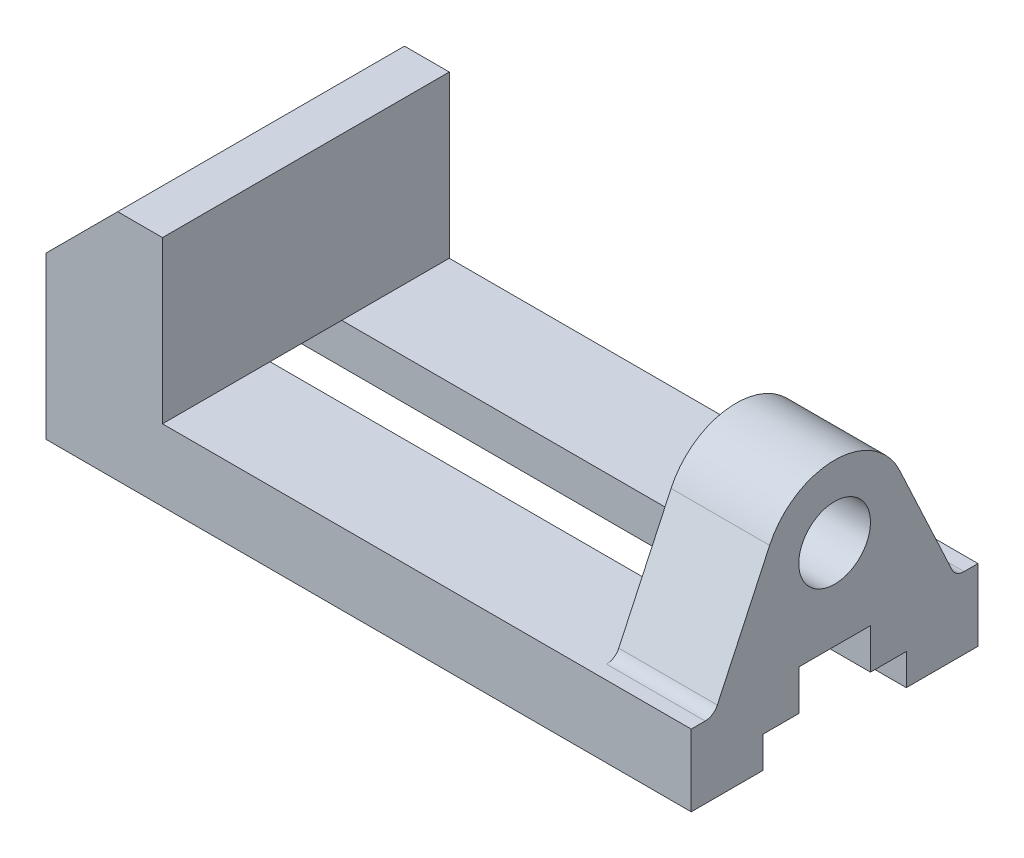
ISO-10303-21;
HEADER;
FILE_DESCRIPTION(('STEP AP214'),'2;1');
FILE_NAME('part.step','',(''),(''),'','','');
FILE_SCHEMA(('AUTOMOTIVE_DESIGN { 1 0 10303 214 1 1 1 1 }'));
ENDSEC;
DATA;
#1=APPLICATION_CONTEXT('core data for automotive mechanical design processes');
#2=APPLICATION_PROTOCOL_DEFINITION('international standard','automotive_design',2000,#1);
#3=PRODUCT_CONTEXT('',#1,'mechanical');
#4=PRODUCT('Part','Part','',(#3));
#5=PRODUCT_RELATED_PRODUCT_CATEGORY('part','',(#4));
#6=PRODUCT_DEFINITION_FORMATION('','',#4);
#7=PRODUCT_DEFINITION_CONTEXT('part definition',#1,'design');
#8=PRODUCT_DEFINITION('design','',#6,#7);
#9=PRODUCT_DEFINITION_SHAPE('','',#8);
#10=(LENGTH_UNIT() NAMED_UNIT(*) SI_UNIT(.MILLI.,.METRE.));
#11=(NAMED_UNIT(*) PLANE_ANGLE_UNIT() SI_UNIT($,.RADIAN.));
#12=(NAMED_UNIT(*) SI_UNIT($,.STERADIAN.) SOLID_ANGLE_UNIT());
#13=UNCERTAINTY_MEASURE_WITH_UNIT(LENGTH_MEASURE(1.E-05),#10,'distance_accuracy_value','');
#14=(GEOMETRIC_REPRESENTATION_CONTEXT(3) GLOBAL_UNCERTAINTY_ASSIGNED_CONTEXT((#13)) GLOBAL_UNIT_ASSIGNED_CONTEXT((#10,
#11,#12)) REPRESENTATION_CONTEXT('',''));
#15=CARTESIAN_POINT('',(0.,0.,0.));
#16=DIRECTION('',(0.,0.,1.));
#17=DIRECTION('',(1.,0.,0.));
#18=AXIS2_PLACEMENT_3D('',#15,#16,#17);
#19=CARTESIAN_POINT('',(0.,0.,32.));
#20=DIRECTION('',(0.,1.,0.));
#21=DIRECTION('',(0.,0.,1.));
#22=AXIS2_PLACEMENT_3D('',#19,#20,#21);
#23=PLANE('',#22);
#24=CARTESIAN_POINT('',(108.,0.,22.));
#25=DIRECTION('',(0.,-1.,0.));
#26=DIRECTION('',(0.,0.,-1.));
#27=AXIS2_PLACEMENT_3D('',#24,#25,#26);
#28=CIRCLE('',#27,2.99999999999999);
#29=CARTESIAN_POINT('',(108.,0.,19.));
#30=VERTEX_POINT('',#29);
#31=EDGE_CURVE('E211',#30,#30,#28,.T.);
#32=ORIENTED_EDGE('',*,*,#31,.F.);
#33=EDGE_LOOP('',(#32));
#34=FACE_BOUND('',#33,.T.);
#35=CARTESIAN_POINT('',(38.,0.,22.));
#36=DIRECTION('',(0.,-1.,0.));
#37=DIRECTION('',(0.,0.,-1.));
#38=AXIS2_PLACEMENT_3D('',#35,#36,#37);
#39=CIRCLE('',#38,2.99999999999999);
#40=CARTESIAN_POINT('',(38.,0.,19.));
#41=VERTEX_POINT('',#40);
#42=EDGE_CURVE('E228',#41,#41,#39,.T.);
#43=ORIENTED_EDGE('',*,*,#42,.F.);
#44=EDGE_LOOP('',(#43));
#45=FACE_BOUND('',#44,.T.);
#46=DIRECTION('',(0.,0.,-1.));
#47=VECTOR('',#46,1.);
#48=CARTESIAN_POINT('',(0.,0.,32.));
#49=LINE('',#48,#47);
#50=CARTESIAN_POINT('',(0.,0.,32.));
#51=VERTEX_POINT('',#50);
#52=CARTESIAN_POINT('',(0.,0.,16.));
#53=VERTEX_POINT('',#52);
#54=EDGE_CURVE('E387',#51,#53,#49,.T.);
#55=ORIENTED_EDGE('',*,*,#54,.T.);
#56=DIRECTION('',(1.,0.,0.));
#57=VECTOR('',#56,1.);
#58=CARTESIAN_POINT('',(0.,0.,16.));
#59=LINE('',#58,#57);
#60=CARTESIAN_POINT('',(144.,0.,16.));
#61=VERTEX_POINT('',#60);
#62=EDGE_CURVE('E255',#53,#61,#59,.T.);
#63=ORIENTED_EDGE('',*,*,#62,.T.);
#64=DIRECTION('',(0.,0.,-1.));
#65=VECTOR('',#64,1.);
#66=CARTESIAN_POINT('',(144.,0.,32.));
#67=LINE('',#66,#65);
#68=CARTESIAN_POINT('',(144.,0.,32.));
#69=VERTEX_POINT('',#68);
#70=EDGE_CURVE('E11',#69,#61,#67,.T.);
#71=ORIENTED_EDGE('',*,*,#70,.F.);
#72=DIRECTION('',(1.,0.,0.));
#73=VECTOR('',#72,1.);
#74=CARTESIAN_POINT('',(0.,0.,32.));
#75=LINE('',#74,#73);
#76=EDGE_CURVE('E354',#51,#69,#75,.T.);
#77=ORIENTED_EDGE('',*,*,#76,.F.);
#78=EDGE_LOOP('',(#55,#63,#71,#77));
#79=FACE_BOUND('',#78,.T.);
#80=ADVANCED_FACE('F35',(#34,#45,#79),#23,.F.);
#81=CARTESIAN_POINT('',(26.,16.,32.));
#82=DIRECTION('',(0.,-1.,0.));
#83=DIRECTION('',(0.,0.,-1.));
#84=AXIS2_PLACEMENT_3D('',#81,#82,#83);
#85=PLANE('',#84);
#86=DIRECTION('',(0.,0.,1.));
#87=VECTOR('',#86,1.);
#88=CARTESIAN_POINT('',(122.,16.,0.));
#89=LINE('',#88,#87);
#90=CARTESIAN_POINT('',(122.,16.,8.));
#91=VERTEX_POINT('',#90);
#92=CARTESIAN_POINT('',(122.,16.,28.8914106489224));
#93=VERTEX_POINT('',#92);
#94=EDGE_CURVE('E314',#91,#93,#89,.T.);
#95=ORIENTED_EDGE('',*,*,#94,.F.);
#96=DIRECTION('',(1.,0.,0.));
#97=VECTOR('',#96,1.);
#98=CARTESIAN_POINT('',(0.,16.,8.));
#99=LINE('',#98,#97);
#100=CARTESIAN_POINT('',(26.,16.,8.));
#101=VERTEX_POINT('',#100);
#102=EDGE_CURVE('E58',#101,#91,#99,.T.);
#103=ORIENTED_EDGE('',*,*,#102,.F.);
#104=DIRECTION('',(0.,0.,-1.));
#105=VECTOR('',#104,1.);
#106=CARTESIAN_POINT('',(26.,16.,32.));
#107=LINE('',#106,#105);
#108=CARTESIAN_POINT('',(26.,16.,32.));
#109=VERTEX_POINT('',#108);
#110=EDGE_CURVE('E400',#109,#101,#107,.T.);
#111=ORIENTED_EDGE('',*,*,#110,.F.);
#112=DIRECTION('',(-1.,0.,0.));
#113=VECTOR('',#112,1.);
#114=CARTESIAN_POINT('',(26.,16.,32.));
#115=LINE('',#114,#113);
#116=CARTESIAN_POINT('',(144.,16.,32.));
#117=VERTEX_POINT('',#116);
#118=EDGE_CURVE('E360',#117,#109,#115,.T.);
#119=ORIENTED_EDGE('',*,*,#118,.F.);
#120=DIRECTION('',(0.,0.,-1.));
#121=VECTOR('',#120,1.);
#122=CARTESIAN_POINT('',(144.,16.,32.));
#123=LINE('',#122,#121);
#124=CARTESIAN_POINT('',(144.,16.,28.8914106489224));
#125=VERTEX_POINT('',#124);
#126=EDGE_CURVE('E403',#117,#125,#123,.T.);
#127=ORIENTED_EDGE('',*,*,#126,.T.);
#128=DIRECTION('',(1.,0.,0.));
#129=VECTOR('',#128,1.);
#130=CARTESIAN_POINT('',(122.,16.,28.8914106489224));
#131=LINE('',#130,#129);
#132=EDGE_CURVE('E346',#93,#125,#131,.T.);
#133=ORIENTED_EDGE('',*,*,#132,.F.);
#134=EDGE_LOOP('',(#95,#103,#111,#119,#127,#133));
#135=FACE_BOUND('',#134,.T.);
#136=ADVANCED_FACE('F439',(#135),#85,.F.);
#137=CARTESIAN_POINT('',(108.,0.,-22.));
#138=DIRECTION('',(0.,-1.,0.));
#139=DIRECTION('',(0.,0.,-1.));
#140=AXIS2_PLACEMENT_3D('',#137,#138,#139);
#141=CIRCLE('',#140,2.99999999999999);
#142=CARTESIAN_POINT('',(108.,0.,-25.));
#143=VERTEX_POINT('',#142);
#144=EDGE_CURVE('E212',#143,#143,#141,.T.);
#145=ORIENTED_EDGE('',*,*,#144,.F.);
#146=EDGE_LOOP('',(#145));
#147=FACE_BOUND('',#146,.T.);
#148=CARTESIAN_POINT('',(38.,0.,-22.));
#149=DIRECTION('',(0.,-1.,0.));
#150=DIRECTION('',(0.,0.,-1.));
#151=AXIS2_PLACEMENT_3D('',#148,#149,#150);
#152=CIRCLE('',#151,2.99999999999999);
#153=CARTESIAN_POINT('',(38.,0.,-25.));
#154=VERTEX_POINT('',#153);
#155=EDGE_CURVE('E222',#154,#154,#152,.T.);
#156=ORIENTED_EDGE('',*,*,#155,.F.);
#157=EDGE_LOOP('',(#156));
#158=FACE_BOUND('',#157,.T.);
#159=CARTESIAN_POINT('',(144.,0.,-16.));
#160=VERTEX_POINT('',#159);
#161=CARTESIAN_POINT('',(144.,0.,-32.));
#162=VERTEX_POINT('',#161);
#163=EDGE_CURVE('E43',#160,#162,#67,.T.);
#164=ORIENTED_EDGE('',*,*,#163,.F.);
#165=DIRECTION('',(1.,0.,0.));
#166=VECTOR('',#165,1.);
#167=CARTESIAN_POINT('',(0.,0.,-16.));
#168=LINE('',#167,#166);
#169=CARTESIAN_POINT('',(0.,0.,-16.));
#170=VERTEX_POINT('',#169);
#171=EDGE_CURVE('E291',#170,#160,#168,.T.);
#172=ORIENTED_EDGE('',*,*,#171,.F.);
#173=CARTESIAN_POINT('',(0.,0.,-32.));
#174=VERTEX_POINT('',#173);
#175=EDGE_CURVE('E370',#170,#174,#49,.T.);
#176=ORIENTED_EDGE('',*,*,#175,.T.);
#177=DIRECTION('',(1.,0.,0.));
#178=VECTOR('',#177,1.);
#179=CARTESIAN_POINT('',(0.,0.,-32.));
#180=LINE('',#179,#178);
#181=EDGE_CURVE('E342',#174,#162,#180,.T.);
#182=ORIENTED_EDGE('',*,*,#181,.T.);
#183=EDGE_LOOP('',(#164,#172,#176,#182));
#184=FACE_BOUND('',#183,.T.);
#185=ADVANCED_FACE('F37',(#147,#158,#184),#23,.F.);
#186=CARTESIAN_POINT('',(144.,16.,32.));
#187=DIRECTION('',(-1.,0.,0.));
#188=DIRECTION('',(0.,0.,1.));
#189=AXIS2_PLACEMENT_3D('',#186,#187,#188);
#190=PLANE('',#189);
#191=ORIENTED_EDGE('',*,*,#70,.T.);
#192=DIRECTION('',(0.,-1.,0.));
#193=VECTOR('',#192,1.);
#194=CARTESIAN_POINT('',(144.,0.,16.));
#195=LINE('',#194,#193);
#196=CARTESIAN_POINT('',(144.,7.,16.));
#197=VERTEX_POINT('',#196);
#198=EDGE_CURVE('E234',#197,#61,#195,.T.);
#199=ORIENTED_EDGE('',*,*,#198,.F.);
#200=DIRECTION('',(0.,0.,1.));
#201=VECTOR('',#200,1.);
#202=CARTESIAN_POINT('',(144.,7.,16.));
#203=LINE('',#202,#201);
#204=CARTESIAN_POINT('',(144.,7.,8.));
#205=VERTEX_POINT('',#204);
#206=EDGE_CURVE('E239',#205,#197,#203,.T.);
#207=ORIENTED_EDGE('',*,*,#206,.F.);
#208=DIRECTION('',(0.,-1.,0.));
#209=VECTOR('',#208,1.);
#210=CARTESIAN_POINT('',(144.,7.,8.));
#211=LINE('',#210,#209);
#212=CARTESIAN_POINT('',(144.,16.,8.));
#213=VERTEX_POINT('',#212);
#214=EDGE_CURVE('E269',#213,#205,#211,.T.);
#215=ORIENTED_EDGE('',*,*,#214,.F.);
#216=DIRECTION('',(0.,0.,1.));
#217=VECTOR('',#216,1.);
#218=CARTESIAN_POINT('',(144.,16.,8.));
#219=LINE('',#218,#217);
#220=CARTESIAN_POINT('',(144.,16.,-8.));
#221=VERTEX_POINT('',#220);
#222=EDGE_CURVE('E266',#221,#213,#219,.T.);
#223=ORIENTED_EDGE('',*,*,#222,.F.);
#224=DIRECTION('',(0.,1.,0.));
#225=VECTOR('',#224,1.);
#226=CARTESIAN_POINT('',(144.,16.,-8.));
#227=LINE('',#226,#225);
#228=CARTESIAN_POINT('',(144.,7.,-8.));
#229=VERTEX_POINT('',#228);
#230=EDGE_CURVE('E263',#229,#221,#227,.T.);
#231=ORIENTED_EDGE('',*,*,#230,.F.);
#232=DIRECTION('',(0.,0.,1.));
#233=VECTOR('',#232,1.);
#234=CARTESIAN_POINT('',(144.,7.,-8.));
#235=LINE('',#234,#233);
#236=CARTESIAN_POINT('',(144.,7.,-16.));
#237=VERTEX_POINT('',#236);
#238=EDGE_CURVE('E260',#237,#229,#235,.T.);
#239=ORIENTED_EDGE('',*,*,#238,.F.);
#240=DIRECTION('',(0.,1.,0.));
#241=VECTOR('',#240,1.);
#242=CARTESIAN_POINT('',(144.,0.,-16.));
#243=LINE('',#242,#241);
#244=EDGE_CURVE('E257',#160,#237,#243,.T.);
#245=ORIENTED_EDGE('',*,*,#244,.F.);
#246=ORIENTED_EDGE('',*,*,#163,.T.);
#247=DIRECTION('',(0.,1.,0.));
#248=VECTOR('',#247,1.);
#249=CARTESIAN_POINT('',(144.,16.,-32.));
#250=LINE('',#249,#248);
#251=CARTESIAN_POINT('',(144.,16.,-32.));
#252=VERTEX_POINT('',#251);
#253=EDGE_CURVE('E373',#162,#252,#250,.T.);
#254=ORIENTED_EDGE('',*,*,#253,.T.);
#255=CARTESIAN_POINT('',(144.,16.,-28.8914106489224));
#256=VERTEX_POINT('',#255);
#257=EDGE_CURVE('E402',#256,#252,#123,.T.);
#258=ORIENTED_EDGE('',*,*,#257,.F.);
#259=CARTESIAN_POINT('',(144.,19.,-28.8914106489223));
#260=DIRECTION('',(1.,0.,0.));
#261=DIRECTION('',(0.,0.,-1.));
#262=AXIS2_PLACEMENT_3D('',#259,#260,#261);
#263=CIRCLE('',#262,3.);
#264=CARTESIAN_POINT('',(144.,17.7321452147779,-26.1724872878124));
#265=VERTEX_POINT('',#264);
#266=EDGE_CURVE('E302',#265,#256,#263,.T.);
#267=ORIENTED_EDGE('',*,*,#266,.F.);
#268=DIRECTION('',(0.,-0.90630778703665,-0.4226182617407));
#269=VECTOR('',#268,1.);
#270=CARTESIAN_POINT('',(144.,13.1917152134935,-28.289724568728));
#271=LINE('',#270,#269);
#272=CARTESIAN_POINT('',(144.,42.7618921878512,-14.5009245925864));
#273=VERTEX_POINT('',#272);
#274=EDGE_CURVE('E325',#273,#265,#271,.T.);
#275=ORIENTED_EDGE('',*,*,#274,.F.);
#276=CARTESIAN_POINT('',(144.,36.,0.));
#277=DIRECTION('',(1.,0.,0.));
#278=DIRECTION('',(0.,0.,-1.));
#279=AXIS2_PLACEMENT_3D('',#276,#277,#278);
#280=CIRCLE('',#279,16.);
#281=CARTESIAN_POINT('',(144.,42.7618921878512,14.5009245925864));
#282=VERTEX_POINT('',#281);
#283=EDGE_CURVE('E328',#273,#282,#280,.T.);
#284=ORIENTED_EDGE('',*,*,#283,.T.);
#285=DIRECTION('',(0.,-0.90630778703665,0.4226182617407));
#286=VECTOR('',#285,1.);
#287=CARTESIAN_POINT('',(144.,13.1917152134935,28.289724568728));
#288=LINE('',#287,#286);
#289=CARTESIAN_POINT('',(144.,17.7321452147779,26.1724872878124));
#290=VERTEX_POINT('',#289);
#291=EDGE_CURVE('E331',#282,#290,#288,.T.);
#292=ORIENTED_EDGE('',*,*,#291,.T.);
#293=CARTESIAN_POINT('',(144.,19.,28.8914106489223));
#294=DIRECTION('',(1.,0.,0.));
#295=DIRECTION('',(0.,0.,-1.));
#296=AXIS2_PLACEMENT_3D('',#293,#294,#295);
#297=CIRCLE('',#296,3.);
#298=EDGE_CURVE('E334',#290,#125,#297,.F.);
#299=ORIENTED_EDGE('',*,*,#298,.T.);
#300=ORIENTED_EDGE('',*,*,#126,.F.);
#301=DIRECTION('',(0.,1.,0.));
#302=VECTOR('',#301,1.);
#303=CARTESIAN_POINT('',(144.,16.,32.));
#304=LINE('',#303,#302);
#305=EDGE_CURVE('E357',#69,#117,#304,.T.);
#306=ORIENTED_EDGE('',*,*,#305,.F.);
#307=EDGE_LOOP('',(#191,#199,#207,#215,#223,#231,#239,#245,#246,#254,#258,#267,#275,#284,#292,
#299,#300,#306));
#308=FACE_BOUND('',#307,.T.);
#309=CARTESIAN_POINT('',(144.,36.,0.));
#310=DIRECTION('',(1.,0.,0.));
#311=DIRECTION('',(0.,0.,-1.));
#312=AXIS2_PLACEMENT_3D('',#309,#310,#311);
#313=CIRCLE('',#312,8.);
#314=CARTESIAN_POINT('',(144.,36.,-8.));
#315=VERTEX_POINT('',#314);
#316=EDGE_CURVE('E297',#315,#315,#313,.T.);
#317=ORIENTED_EDGE('',*,*,#316,.F.);
#318=EDGE_LOOP('',(#317));
#319=FACE_BOUND('',#318,.T.);
#320=ADVANCED_FACE('F416',(#308,#319),#190,.F.);
#321=CARTESIAN_POINT('',(26.,16.,-8.));
#322=VERTEX_POINT('',#321);
#323=CARTESIAN_POINT('',(26.,16.,-32.));
#324=VERTEX_POINT('',#323);
#325=EDGE_CURVE('E399',#322,#324,#107,.T.);
#326=ORIENTED_EDGE('',*,*,#325,.F.);
#327=DIRECTION('',(1.,0.,0.));
#328=VECTOR('',#327,1.);
#329=CARTESIAN_POINT('',(0.,16.,-8.));
#330=LINE('',#329,#328);
#331=CARTESIAN_POINT('',(122.,16.,-8.));
#332=VERTEX_POINT('',#331);
#333=EDGE_CURVE('E285',#322,#332,#330,.T.);
#334=ORIENTED_EDGE('',*,*,#333,.T.);
#335=CARTESIAN_POINT('',(122.,16.,-28.8914106489224));
#336=VERTEX_POINT('',#335);
#337=EDGE_CURVE('E315',#336,#332,#89,.T.);
#338=ORIENTED_EDGE('',*,*,#337,.F.);
#339=DIRECTION('',(1.,0.,0.));
#340=VECTOR('',#339,1.);
#341=CARTESIAN_POINT('',(122.,16.,-28.8914106489224));
#342=LINE('',#341,#340);
#343=EDGE_CURVE('E343',#336,#256,#342,.T.);
#344=ORIENTED_EDGE('',*,*,#343,.T.);
#345=ORIENTED_EDGE('',*,*,#257,.T.);
#346=DIRECTION('',(-1.,0.,0.));
#347=VECTOR('',#346,1.);
#348=CARTESIAN_POINT('',(26.,16.,-32.));
#349=LINE('',#348,#347);
#350=EDGE_CURVE('E376',#252,#324,#349,.T.);
#351=ORIENTED_EDGE('',*,*,#350,.T.);
#352=EDGE_LOOP('',(#326,#334,#338,#344,#345,#351));
#353=FACE_BOUND('',#352,.T.);
#354=ADVANCED_FACE('F410',(#353),#85,.F.);
#355=CARTESIAN_POINT('',(26.,52.,32.));
#356=DIRECTION('',(-1.,0.,0.));
#357=DIRECTION('',(0.,-1.,0.));
#358=AXIS2_PLACEMENT_3D('',#355,#356,#357);
#359=PLANE('',#358);
#360=DIRECTION('',(0.,1.,0.));
#361=VECTOR('',#360,1.);
#362=CARTESIAN_POINT('',(26.,52.,-32.));
#363=LINE('',#362,#361);
#364=CARTESIAN_POINT('',(26.,52.,-32.));
#365=VERTEX_POINT('',#364);
#366=EDGE_CURVE('E379',#324,#365,#363,.T.);
#367=ORIENTED_EDGE('',*,*,#366,.T.);
#368=DIRECTION('',(0.,0.,-1.));
#369=VECTOR('',#368,1.);
#370=CARTESIAN_POINT('',(26.,52.,32.));
#371=LINE('',#370,#369);
#372=CARTESIAN_POINT('',(26.,52.,32.));
#373=VERTEX_POINT('',#372);
#374=EDGE_CURVE('E396',#373,#365,#371,.T.);
#375=ORIENTED_EDGE('',*,*,#374,.F.);
#376=DIRECTION('',(0.,1.,0.));
#377=VECTOR('',#376,1.);
#378=CARTESIAN_POINT('',(26.,52.,32.));
#379=LINE('',#378,#377);
#380=EDGE_CURVE('E362',#109,#373,#379,.T.);
#381=ORIENTED_EDGE('',*,*,#380,.F.);
#382=ORIENTED_EDGE('',*,*,#110,.T.);
#383=DIRECTION('',(0.,0.,-1.));
#384=VECTOR('',#383,1.);
#385=CARTESIAN_POINT('',(26.,16.,32.));
#386=LINE('',#385,#384);
#387=EDGE_CURVE('E276',#101,#322,#386,.T.);
#388=ORIENTED_EDGE('',*,*,#387,.T.);
#389=ORIENTED_EDGE('',*,*,#325,.T.);
#390=EDGE_LOOP('',(#367,#375,#381,#382,#388,#389));
#391=FACE_BOUND('',#390,.T.);
#392=ADVANCED_FACE('F427',(#391),#359,.F.);
#393=CARTESIAN_POINT('',(16.,52.,32.));
#394=DIRECTION('',(0.,-1.,0.));
#395=DIRECTION('',(1.,0.,0.));
#396=AXIS2_PLACEMENT_3D('',#393,#394,#395);
#397=PLANE('',#396);
#398=DIRECTION('',(-1.,0.,0.));
#399=VECTOR('',#398,1.);
#400=CARTESIAN_POINT('',(16.,52.,-32.));
#401=LINE('',#400,#399);
#402=CARTESIAN_POINT('',(16.,52.,-32.));
#403=VERTEX_POINT('',#402);
#404=EDGE_CURVE('E381',#365,#403,#401,.T.);
#405=ORIENTED_EDGE('',*,*,#404,.T.);
#406=DIRECTION('',(0.,0.,-1.));
#407=VECTOR('',#406,1.);
#408=CARTESIAN_POINT('',(16.,52.,32.));
#409=LINE('',#408,#407);
#410=CARTESIAN_POINT('',(16.,52.,32.));
#411=VERTEX_POINT('',#410);
#412=EDGE_CURVE('E393',#411,#403,#409,.T.);
#413=ORIENTED_EDGE('',*,*,#412,.F.);
#414=DIRECTION('',(-1.,0.,0.));
#415=VECTOR('',#414,1.);
#416=CARTESIAN_POINT('',(16.,52.,32.));
#417=LINE('',#416,#415);
#418=EDGE_CURVE('E364',#373,#411,#417,.T.);
#419=ORIENTED_EDGE('',*,*,#418,.F.);
#420=ORIENTED_EDGE('',*,*,#374,.T.);
#421=EDGE_LOOP('',(#405,#413,#419,#420));
#422=FACE_BOUND('',#421,.T.);
#423=ADVANCED_FACE('F431',(#422),#397,.F.);
#424=CARTESIAN_POINT('',(0.,36.,32.));
#425=DIRECTION('',(0.707106781186548,-0.707106781186547,0.));
#426=DIRECTION('',(0.707106781186547,0.707106781186548,0.));
#427=AXIS2_PLACEMENT_3D('',#424,#425,#426);
#428=PLANE('',#427);
#429=DIRECTION('',(-0.707106781186548,-0.707106781186548,0.));
#430=VECTOR('',#429,1.);
#431=CARTESIAN_POINT('',(0.,36.,-32.));
#432=LINE('',#431,#430);
#433=CARTESIAN_POINT('',(0.,36.,-32.));
#434=VERTEX_POINT('',#433);
#435=EDGE_CURVE('E383',#403,#434,#432,.T.);
#436=ORIENTED_EDGE('',*,*,#435,.T.);
#437=DIRECTION('',(0.,0.,-1.));
#438=VECTOR('',#437,1.);
#439=CARTESIAN_POINT('',(0.,36.,32.));
#440=LINE('',#439,#438);
#441=CARTESIAN_POINT('',(0.,36.,32.));
#442=VERTEX_POINT('',#441);
#443=EDGE_CURVE('E390',#442,#434,#440,.T.);
#444=ORIENTED_EDGE('',*,*,#443,.F.);
#445=DIRECTION('',(-0.707106781186548,-0.707106781186548,0.));
#446=VECTOR('',#445,1.);
#447=CARTESIAN_POINT('',(0.,36.,32.));
#448=LINE('',#447,#446);
#449=EDGE_CURVE('E366',#411,#442,#448,.T.);
#450=ORIENTED_EDGE('',*,*,#449,.F.);
#451=ORIENTED_EDGE('',*,*,#412,.T.);
#452=EDGE_LOOP('',(#436,#444,#450,#451));
#453=FACE_BOUND('',#452,.T.);
#454=ADVANCED_FACE('F516',(#453),#428,.F.);
#455=CARTESIAN_POINT('',(0.,0.,32.));
#456=DIRECTION('',(1.,0.,0.));
#457=DIRECTION('',(0.,0.,-1.));
#458=AXIS2_PLACEMENT_3D('',#455,#456,#457);
#459=PLANE('',#458);
#460=DIRECTION('',(0.,0.,1.));
#461=VECTOR('',#460,1.);
#462=CARTESIAN_POINT('',(0.,7.,16.));
#463=LINE('',#462,#461);
#464=CARTESIAN_POINT('',(0.,7.,8.));
#465=VERTEX_POINT('',#464);
#466=CARTESIAN_POINT('',(0.,7.,16.));
#467=VERTEX_POINT('',#466);
#468=EDGE_CURVE('E252',#465,#467,#463,.T.);
#469=ORIENTED_EDGE('',*,*,#468,.T.);
#470=DIRECTION('',(0.,-1.,0.));
#471=VECTOR('',#470,1.);
#472=CARTESIAN_POINT('',(0.,0.,16.));
#473=LINE('',#472,#471);
#474=EDGE_CURVE('E235',#467,#53,#473,.T.);
#475=ORIENTED_EDGE('',*,*,#474,.T.);
#476=ORIENTED_EDGE('',*,*,#54,.F.);
#477=DIRECTION('',(0.,-1.,0.));
#478=VECTOR('',#477,1.);
#479=CARTESIAN_POINT('',(0.,0.,32.));
#480=LINE('',#479,#478);
#481=EDGE_CURVE('E368',#442,#51,#480,.T.);
#482=ORIENTED_EDGE('',*,*,#481,.F.);
#483=ORIENTED_EDGE('',*,*,#443,.T.);
#484=DIRECTION('',(0.,-1.,0.));
#485=VECTOR('',#484,1.);
#486=CARTESIAN_POINT('',(0.,0.,-32.));
#487=LINE('',#486,#485);
#488=EDGE_CURVE('E358',#434,#174,#487,.T.);
#489=ORIENTED_EDGE('',*,*,#488,.T.);
#490=ORIENTED_EDGE('',*,*,#175,.F.);
#491=DIRECTION('',(0.,1.,0.));
#492=VECTOR('',#491,1.);
#493=CARTESIAN_POINT('',(0.,0.,-16.));
#494=LINE('',#493,#492);
#495=CARTESIAN_POINT('',(0.,7.,-16.));
#496=VERTEX_POINT('',#495);
#497=EDGE_CURVE('E238',#170,#496,#494,.T.);
#498=ORIENTED_EDGE('',*,*,#497,.T.);
#499=DIRECTION('',(0.,0.,1.));
#500=VECTOR('',#499,1.);
#501=CARTESIAN_POINT('',(0.,7.,-8.));
#502=LINE('',#501,#500);
#503=CARTESIAN_POINT('',(0.,7.,-8.));
#504=VERTEX_POINT('',#503);
#505=EDGE_CURVE('E50',#496,#504,#502,.T.);
#506=ORIENTED_EDGE('',*,*,#505,.T.);
#507=DIRECTION('',(0.,1.,0.));
#508=VECTOR('',#507,1.);
#509=CARTESIAN_POINT('',(0.,16.,-8.));
#510=LINE('',#509,#508);
#511=CARTESIAN_POINT('',(0.,16.,-8.));
#512=VERTEX_POINT('',#511);
#513=EDGE_CURVE('E243',#504,#512,#510,.T.);
#514=ORIENTED_EDGE('',*,*,#513,.T.);
#515=DIRECTION('',(0.,0.,1.));
#516=VECTOR('',#515,1.);
#517=CARTESIAN_POINT('',(0.,16.,8.));
#518=LINE('',#517,#516);
#519=CARTESIAN_POINT('',(0.,16.,8.));
#520=VERTEX_POINT('',#519);
#521=EDGE_CURVE('E246',#512,#520,#518,.T.);
#522=ORIENTED_EDGE('',*,*,#521,.T.);
#523=DIRECTION('',(0.,-1.,0.));
#524=VECTOR('',#523,1.);
#525=CARTESIAN_POINT('',(0.,7.,8.));
#526=LINE('',#525,#524);
#527=EDGE_CURVE('E249',#520,#465,#526,.T.);
#528=ORIENTED_EDGE('',*,*,#527,.T.);
#529=EDGE_LOOP('',(#469,#475,#476,#482,#483,#489,#490,#498,#506,#514,#522,#528));
#530=FACE_BOUND('',#529,.T.);
#531=ADVANCED_FACE('F457',(#530),#459,.F.);
#532=CARTESIAN_POINT('',(0.,0.,32.));
#533=DIRECTION('',(0.,0.,-1.));
#534=DIRECTION('',(-1.,0.,0.));
#535=AXIS2_PLACEMENT_3D('',#532,#533,#534);
#536=PLANE('',#535);
#537=ORIENTED_EDGE('',*,*,#76,.T.);
#538=ORIENTED_EDGE('',*,*,#305,.T.);
#539=ORIENTED_EDGE('',*,*,#118,.T.);
#540=ORIENTED_EDGE('',*,*,#380,.T.);
#541=ORIENTED_EDGE('',*,*,#418,.T.);
#542=ORIENTED_EDGE('',*,*,#449,.T.);
#543=ORIENTED_EDGE('',*,*,#481,.T.);
#544=EDGE_LOOP('',(#537,#538,#539,#540,#541,#542,#543));
#545=FACE_BOUND('',#544,.T.);
#546=ADVANCED_FACE('F435',(#545),#536,.F.);
#547=CARTESIAN_POINT('',(0.,0.,-32.));
#548=DIRECTION('',(0.,0.,-1.));
#549=DIRECTION('',(-1.,0.,0.));
#550=AXIS2_PLACEMENT_3D('',#547,#548,#549);
#551=PLANE('',#550);
#552=ORIENTED_EDGE('',*,*,#181,.F.);
#553=ORIENTED_EDGE('',*,*,#488,.F.);
#554=ORIENTED_EDGE('',*,*,#435,.F.);
#555=ORIENTED_EDGE('',*,*,#404,.F.);
#556=ORIENTED_EDGE('',*,*,#366,.F.);
#557=ORIENTED_EDGE('',*,*,#350,.F.);
#558=ORIENTED_EDGE('',*,*,#253,.F.);
#559=EDGE_LOOP('',(#552,#553,#554,#555,#556,#557,#558));
#560=FACE_BOUND('',#559,.T.);
#561=ADVANCED_FACE('F422',(#560),#551,.T.);
#562=CARTESIAN_POINT('',(122.,13.1917152134935,-28.289724568728));
#563=DIRECTION('',(0.,-0.4226182617407,0.906307787036649));
#564=DIRECTION('',(0.,-0.906307787036649,-0.4226182617407));
#565=AXIS2_PLACEMENT_3D('',#562,#563,#564);
#566=PLANE('',#565);
#567=ORIENTED_EDGE('',*,*,#274,.T.);
#568=DIRECTION('',(1.,0.,0.));
#569=VECTOR('',#568,1.);
#570=CARTESIAN_POINT('',(122.,17.7321452147779,-26.1724872878124));
#571=LINE('',#570,#569);
#572=CARTESIAN_POINT('',(122.,17.7321452147779,-26.1724872878124));
#573=VERTEX_POINT('',#572);
#574=EDGE_CURVE('E339',#573,#265,#571,.T.);
#575=ORIENTED_EDGE('',*,*,#574,.F.);
#576=DIRECTION('',(0.,-0.90630778703665,-0.4226182617407));
#577=VECTOR('',#576,1.);
#578=CARTESIAN_POINT('',(122.,13.1917152134935,-28.289724568728));
#579=LINE('',#578,#577);
#580=CARTESIAN_POINT('',(122.,42.7618921878512,-14.5009245925864));
#581=VERTEX_POINT('',#580);
#582=EDGE_CURVE('E301',#581,#573,#579,.T.);
#583=ORIENTED_EDGE('',*,*,#582,.F.);
#584=DIRECTION('',(1.,0.,0.));
#585=VECTOR('',#584,1.);
#586=CARTESIAN_POINT('',(122.,42.7618921878512,-14.5009245925864));
#587=LINE('',#586,#585);
#588=EDGE_CURVE('E322',#581,#273,#587,.T.);
#589=ORIENTED_EDGE('',*,*,#588,.T.);
#590=EDGE_LOOP('',(#567,#575,#583,#589));
#591=FACE_BOUND('',#590,.T.);
#592=ADVANCED_FACE('F491',(#591),#566,.F.);
#593=CARTESIAN_POINT('',(122.,19.,-28.8914106489223));
#594=DIRECTION('',(1.,0.,0.));
#595=DIRECTION('',(0.,0.,-1.));
#596=AXIS2_PLACEMENT_3D('',#593,#594,#595);
#597=CYLINDRICAL_SURFACE('',#596,3.);
#598=ORIENTED_EDGE('',*,*,#266,.T.);
#599=ORIENTED_EDGE('',*,*,#343,.F.);
#600=CARTESIAN_POINT('',(122.,19.,-28.8914106489223));
#601=DIRECTION('',(1.,0.,0.));
#602=DIRECTION('',(0.,0.,-1.));
#603=AXIS2_PLACEMENT_3D('',#600,#601,#602);
#604=CIRCLE('',#603,3.);
#605=EDGE_CURVE('E318',#573,#336,#604,.T.);
#606=ORIENTED_EDGE('',*,*,#605,.F.);
#607=ORIENTED_EDGE('',*,*,#574,.T.);
#608=EDGE_LOOP('',(#598,#599,#606,#607));
#609=FACE_BOUND('',#608,.T.);
#610=ADVANCED_FACE('F469',(#609),#597,.F.);
#611=CARTESIAN_POINT('',(122.,19.,28.8914106489223));
#612=DIRECTION('',(1.,0.,0.));
#613=DIRECTION('',(0.,0.,-1.));
#614=AXIS2_PLACEMENT_3D('',#611,#612,#613);
#615=CYLINDRICAL_SURFACE('',#614,3.);
#616=ORIENTED_EDGE('',*,*,#298,.F.);
#617=DIRECTION('',(1.,0.,0.));
#618=VECTOR('',#617,1.);
#619=CARTESIAN_POINT('',(122.,17.7321452147779,26.1724872878124));
#620=LINE('',#619,#618);
#621=CARTESIAN_POINT('',(122.,17.7321452147779,26.1724872878124));
#622=VERTEX_POINT('',#621);
#623=EDGE_CURVE('E349',#622,#290,#620,.T.);
#624=ORIENTED_EDGE('',*,*,#623,.F.);
#625=CARTESIAN_POINT('',(122.,19.,28.8914106489223));
#626=DIRECTION('',(1.,0.,0.));
#627=DIRECTION('',(0.,0.,-1.));
#628=AXIS2_PLACEMENT_3D('',#625,#626,#627);
#629=CIRCLE('',#628,3.);
#630=EDGE_CURVE('E311',#622,#93,#629,.F.);
#631=ORIENTED_EDGE('',*,*,#630,.T.);
#632=ORIENTED_EDGE('',*,*,#132,.T.);
#633=EDGE_LOOP('',(#616,#624,#631,#632));
#634=FACE_BOUND('',#633,.T.);
#635=ADVANCED_FACE('F481',(#634),#615,.F.);
#636=CARTESIAN_POINT('',(122.,13.1917152134935,28.289724568728));
#637=DIRECTION('',(0.,0.4226182617407,0.90630778703665));
#638=DIRECTION('',(0.,-0.90630778703665,0.4226182617407));
#639=AXIS2_PLACEMENT_3D('',#636,#637,#638);
#640=PLANE('',#639);
#641=ORIENTED_EDGE('',*,*,#291,.F.);
#642=DIRECTION('',(1.,0.,0.));
#643=VECTOR('',#642,1.);
#644=CARTESIAN_POINT('',(122.,42.7618921878512,14.5009245925864));
#645=LINE('',#644,#643);
#646=CARTESIAN_POINT('',(122.,42.7618921878512,14.5009245925864));
#647=VERTEX_POINT('',#646);
#648=EDGE_CURVE('E351',#647,#282,#645,.T.);
#649=ORIENTED_EDGE('',*,*,#648,.F.);
#650=DIRECTION('',(0.,-0.90630778703665,0.4226182617407));
#651=VECTOR('',#650,1.);
#652=CARTESIAN_POINT('',(122.,13.1917152134935,28.289724568728));
#653=LINE('',#652,#651);
#654=EDGE_CURVE('E308',#647,#622,#653,.T.);
#655=ORIENTED_EDGE('',*,*,#654,.T.);
#656=ORIENTED_EDGE('',*,*,#623,.T.);
#657=EDGE_LOOP('',(#641,#649,#655,#656));
#658=FACE_BOUND('',#657,.T.);
#659=ADVANCED_FACE('F478',(#658),#640,.T.);
#660=CARTESIAN_POINT('',(122.,36.,0.));
#661=DIRECTION('',(1.,0.,0.));
#662=DIRECTION('',(0.,0.,-1.));
#663=AXIS2_PLACEMENT_3D('',#660,#661,#662);
#664=CYLINDRICAL_SURFACE('',#663,8.);
#665=CARTESIAN_POINT('',(122.,36.,0.));
#666=DIRECTION('',(1.,0.,0.));
#667=DIRECTION('',(0.,0.,-1.));
#668=AXIS2_PLACEMENT_3D('',#665,#666,#667);
#669=CIRCLE('',#668,8.);
#670=CARTESIAN_POINT('',(122.,36.,-8.));
#671=VERTEX_POINT('',#670);
#672=EDGE_CURVE('E298',#671,#671,#669,.T.);
#673=ORIENTED_EDGE('',*,*,#672,.F.);
#674=EDGE_LOOP('',(#673));
#675=FACE_BOUND('',#674,.T.);
#676=ORIENTED_EDGE('',*,*,#316,.T.);
#677=EDGE_LOOP('',(#676));
#678=FACE_BOUND('',#677,.T.);
#679=ADVANCED_FACE('F489',(#675,#678),#664,.F.);
#680=CARTESIAN_POINT('',(122.,36.,0.));
#681=DIRECTION('',(1.,0.,0.));
#682=DIRECTION('',(0.,0.,-1.));
#683=AXIS2_PLACEMENT_3D('',#680,#681,#682);
#684=CYLINDRICAL_SURFACE('',#683,16.);
#685=ORIENTED_EDGE('',*,*,#283,.F.);
#686=ORIENTED_EDGE('',*,*,#588,.F.);
#687=CARTESIAN_POINT('',(122.,36.,0.));
#688=DIRECTION('',(1.,0.,0.));
#689=DIRECTION('',(0.,0.,-1.));
#690=AXIS2_PLACEMENT_3D('',#687,#688,#689);
#691=CIRCLE('',#690,16.);
#692=EDGE_CURVE('E305',#581,#647,#691,.T.);
#693=ORIENTED_EDGE('',*,*,#692,.T.);
#694=ORIENTED_EDGE('',*,*,#648,.T.);
#695=EDGE_LOOP('',(#685,#686,#693,#694));
#696=FACE_BOUND('',#695,.T.);
#697=ADVANCED_FACE('F474',(#696),#684,.T.);
#698=CARTESIAN_POINT('',(122.,0.,0.));
#699=DIRECTION('',(1.,0.,0.));
#700=DIRECTION('',(0.,0.,-1.));
#701=AXIS2_PLACEMENT_3D('',#698,#699,#700);
#702=PLANE('',#701);
#703=ORIENTED_EDGE('',*,*,#672,.T.);
#704=EDGE_LOOP('',(#703));
#705=FACE_BOUND('',#704,.T.);
#706=ORIENTED_EDGE('',*,*,#582,.T.);
#707=ORIENTED_EDGE('',*,*,#605,.T.);
#708=ORIENTED_EDGE('',*,*,#337,.T.);
#709=EDGE_CURVE('E319',#332,#91,#89,.T.);
#710=ORIENTED_EDGE('',*,*,#709,.T.);
#711=ORIENTED_EDGE('',*,*,#94,.T.);
#712=ORIENTED_EDGE('',*,*,#630,.F.);
#713=ORIENTED_EDGE('',*,*,#654,.F.);
#714=ORIENTED_EDGE('',*,*,#692,.F.);
#715=EDGE_LOOP('',(#706,#707,#708,#710,#711,#712,#713,#714));
#716=FACE_BOUND('',#715,.T.);
#717=ADVANCED_FACE('F464',(#705,#716),#702,.F.);
#718=CARTESIAN_POINT('',(0.,16.,8.));
#719=DIRECTION('',(0.,1.,0.));
#720=DIRECTION('',(0.,0.,1.));
#721=AXIS2_PLACEMENT_3D('',#718,#719,#720);
#722=PLANE('',#721);
#723=EDGE_CURVE('E279',#520,#101,#99,.T.);
#724=ORIENTED_EDGE('',*,*,#723,.F.);
#725=ORIENTED_EDGE('',*,*,#521,.F.);
#726=EDGE_CURVE('E282',#512,#322,#330,.T.);
#727=ORIENTED_EDGE('',*,*,#726,.T.);
#728=ORIENTED_EDGE('',*,*,#387,.F.);
#729=EDGE_LOOP('',(#724,#725,#727,#728));
#730=FACE_BOUND('',#729,.T.);
#731=ADVANCED_FACE('F460',(#730),#722,.F.);
#732=EDGE_CURVE('E286',#332,#221,#330,.T.);
#733=ORIENTED_EDGE('',*,*,#732,.T.);
#734=ORIENTED_EDGE('',*,*,#222,.T.);
#735=EDGE_CURVE('E281',#91,#213,#99,.T.);
#736=ORIENTED_EDGE('',*,*,#735,.F.);
#737=ORIENTED_EDGE('',*,*,#709,.F.);
#738=EDGE_LOOP('',(#733,#734,#736,#737));
#739=FACE_BOUND('',#738,.T.);
#740=ADVANCED_FACE('F446',(#739),#722,.F.);
#741=CARTESIAN_POINT('',(0.,0.,16.));
#742=DIRECTION('',(0.,0.,1.));
#743=DIRECTION('',(1.,0.,0.));
#744=AXIS2_PLACEMENT_3D('',#741,#742,#743);
#745=PLANE('',#744);
#746=ORIENTED_EDGE('',*,*,#198,.T.);
#747=ORIENTED_EDGE('',*,*,#62,.F.);
#748=ORIENTED_EDGE('',*,*,#474,.F.);
#749=DIRECTION('',(1.,0.,0.));
#750=VECTOR('',#749,1.);
#751=CARTESIAN_POINT('',(0.,7.,16.));
#752=LINE('',#751,#750);
#753=EDGE_CURVE('E274',#467,#197,#752,.T.);
#754=ORIENTED_EDGE('',*,*,#753,.T.);
#755=EDGE_LOOP('',(#746,#747,#748,#754));
#756=FACE_BOUND('',#755,.T.);
#757=ADVANCED_FACE('F704',(#756),#745,.F.);
#758=CARTESIAN_POINT('',(0.,7.,16.));
#759=DIRECTION('',(0.,1.,0.));
#760=DIRECTION('',(0.,0.,1.));
#761=AXIS2_PLACEMENT_3D('',#758,#759,#760);
#762=PLANE('',#761);
#763=ORIENTED_EDGE('',*,*,#206,.T.);
#764=ORIENTED_EDGE('',*,*,#753,.F.);
#765=ORIENTED_EDGE('',*,*,#468,.F.);
#766=DIRECTION('',(1.,0.,0.));
#767=VECTOR('',#766,1.);
#768=CARTESIAN_POINT('',(0.,7.,8.));
#769=LINE('',#768,#767);
#770=EDGE_CURVE('E277',#465,#205,#769,.T.);
#771=ORIENTED_EDGE('',*,*,#770,.T.);
#772=EDGE_LOOP('',(#763,#764,#765,#771));
#773=FACE_BOUND('',#772,.T.);
#774=ADVANCED_FACE('F451',(#773),#762,.F.);
#775=CARTESIAN_POINT('',(0.,7.,8.));
#776=DIRECTION('',(0.,0.,1.));
#777=DIRECTION('',(1.,0.,0.));
#778=AXIS2_PLACEMENT_3D('',#775,#776,#777);
#779=PLANE('',#778);
#780=ORIENTED_EDGE('',*,*,#214,.T.);
#781=ORIENTED_EDGE('',*,*,#770,.F.);
#782=ORIENTED_EDGE('',*,*,#527,.F.);
#783=ORIENTED_EDGE('',*,*,#723,.T.);
#784=ORIENTED_EDGE('',*,*,#102,.T.);
#785=ORIENTED_EDGE('',*,*,#735,.T.);
#786=EDGE_LOOP('',(#780,#781,#782,#783,#784,#785));
#787=FACE_BOUND('',#786,.T.);
#788=ADVANCED_FACE('F441',(#787),#779,.F.);
#789=CARTESIAN_POINT('',(0.,16.,-8.));
#790=DIRECTION('',(0.,0.,-1.));
#791=DIRECTION('',(-1.,0.,0.));
#792=AXIS2_PLACEMENT_3D('',#789,#790,#791);
#793=PLANE('',#792);
#794=ORIENTED_EDGE('',*,*,#230,.T.);
#795=ORIENTED_EDGE('',*,*,#732,.F.);
#796=ORIENTED_EDGE('',*,*,#333,.F.);
#797=ORIENTED_EDGE('',*,*,#726,.F.);
#798=ORIENTED_EDGE('',*,*,#513,.F.);
#799=DIRECTION('',(1.,0.,0.));
#800=VECTOR('',#799,1.);
#801=CARTESIAN_POINT('',(0.,7.,-8.));
#802=LINE('',#801,#800);
#803=EDGE_CURVE('E287',#504,#229,#802,.T.);
#804=ORIENTED_EDGE('',*,*,#803,.T.);
#805=EDGE_LOOP('',(#794,#795,#796,#797,#798,#804));
#806=FACE_BOUND('',#805,.T.);
#807=ADVANCED_FACE('F707',(#806),#793,.F.);
#808=CARTESIAN_POINT('',(0.,7.,-8.));
#809=DIRECTION('',(0.,1.,0.));
#810=DIRECTION('',(0.,0.,1.));
#811=AXIS2_PLACEMENT_3D('',#808,#809,#810);
#812=PLANE('',#811);
#813=ORIENTED_EDGE('',*,*,#238,.T.);
#814=ORIENTED_EDGE('',*,*,#803,.F.);
#815=ORIENTED_EDGE('',*,*,#505,.F.);
#816=DIRECTION('',(1.,0.,0.));
#817=VECTOR('',#816,1.);
#818=CARTESIAN_POINT('',(0.,7.,-16.));
#819=LINE('',#818,#817);
#820=EDGE_CURVE('E289',#496,#237,#819,.T.);
#821=ORIENTED_EDGE('',*,*,#820,.T.);
#822=EDGE_LOOP('',(#813,#814,#815,#821));
#823=FACE_BOUND('',#822,.T.);
#824=ADVANCED_FACE('F712',(#823),#812,.F.);
#825=CARTESIAN_POINT('',(0.,0.,-16.));
#826=DIRECTION('',(0.,0.,-1.));
#827=DIRECTION('',(-1.,0.,0.));
#828=AXIS2_PLACEMENT_3D('',#825,#826,#827);
#829=PLANE('',#828);
#830=ORIENTED_EDGE('',*,*,#244,.T.);
#831=ORIENTED_EDGE('',*,*,#820,.F.);
#832=ORIENTED_EDGE('',*,*,#497,.F.);
#833=ORIENTED_EDGE('',*,*,#171,.T.);
#834=EDGE_LOOP('',(#830,#831,#832,#833));
#835=FACE_BOUND('',#834,.T.);
#836=ADVANCED_FACE('F700',(#835),#829,.F.);
#837=CARTESIAN_POINT('',(38.,10.,22.));
#838=DIRECTION('',(0.,-1.,0.));
#839=DIRECTION('',(0.,0.,-1.));
#840=AXIS2_PLACEMENT_3D('',#837,#838,#839);
#841=CONICAL_SURFACE('',#840,3.,1.02974425867665);
#842=CARTESIAN_POINT('',(38.,11.8025818570827,22.));
#843=VERTEX_POINT('',#842);
#844=VERTEX_LOOP('',#843);
#845=FACE_BOUND('',#844,.T.);
#846=CARTESIAN_POINT('',(38.,10.,22.));
#847=DIRECTION('',(0.,-1.,0.));
#848=DIRECTION('',(0.,0.,-1.));
#849=AXIS2_PLACEMENT_3D('',#846,#847,#848);
#850=CIRCLE('',#849,3.);
#851=CARTESIAN_POINT('',(38.,10.,19.));
#852=VERTEX_POINT('',#851);
#853=EDGE_CURVE('E231',#852,#852,#850,.T.);
#854=ORIENTED_EDGE('',*,*,#853,.T.);
#855=EDGE_LOOP('',(#854));
#856=FACE_BOUND('',#855,.T.);
#857=ADVANCED_FACE('F696',(#845,#856),#841,.F.);
#858=CARTESIAN_POINT('',(38.,0.,22.));
#859=DIRECTION('',(0.,-1.,0.));
#860=DIRECTION('',(0.,0.,-1.));
#861=AXIS2_PLACEMENT_3D('',#858,#859,#860);
#862=CYLINDRICAL_SURFACE('',#861,2.99999999999999);
#863=ORIENTED_EDGE('',*,*,#853,.F.);
#864=EDGE_LOOP('',(#863));
#865=FACE_BOUND('',#864,.T.);
#866=ORIENTED_EDGE('',*,*,#42,.T.);
#867=EDGE_LOOP('',(#866));
#868=FACE_BOUND('',#867,.T.);
#869=ADVANCED_FACE('F644',(#865,#868),#862,.F.);
#870=CARTESIAN_POINT('',(38.,10.,-22.));
#871=DIRECTION('',(0.,-1.,0.));
#872=DIRECTION('',(0.,0.,-1.));
#873=AXIS2_PLACEMENT_3D('',#870,#871,#872);
#874=CONICAL_SURFACE('',#873,3.,1.02974425867665);
#875=CARTESIAN_POINT('',(38.,11.8025818570827,-22.));
#876=VERTEX_POINT('',#875);
#877=VERTEX_LOOP('',#876);
#878=FACE_BOUND('',#877,.T.);
#879=CARTESIAN_POINT('',(38.,10.,-22.));
#880=DIRECTION('',(0.,-1.,0.));
#881=DIRECTION('',(0.,0.,-1.));
#882=AXIS2_PLACEMENT_3D('',#879,#880,#881);
#883=CIRCLE('',#882,3.);
#884=CARTESIAN_POINT('',(38.,10.,-25.));
#885=VERTEX_POINT('',#884);
#886=EDGE_CURVE('E225',#885,#885,#883,.T.);
#887=ORIENTED_EDGE('',*,*,#886,.T.);
#888=EDGE_LOOP('',(#887));
#889=FACE_BOUND('',#888,.T.);
#890=ADVANCED_FACE('F638',(#878,#889),#874,.F.);
#891=CARTESIAN_POINT('',(38.,0.,-22.));
#892=DIRECTION('',(0.,-1.,0.));
#893=DIRECTION('',(0.,0.,-1.));
#894=AXIS2_PLACEMENT_3D('',#891,#892,#893);
#895=CYLINDRICAL_SURFACE('',#894,2.99999999999999);
#896=ORIENTED_EDGE('',*,*,#886,.F.);
#897=EDGE_LOOP('',(#896));
#898=FACE_BOUND('',#897,.T.);
#899=ORIENTED_EDGE('',*,*,#155,.T.);
#900=EDGE_LOOP('',(#899));
#901=FACE_BOUND('',#900,.T.);
#902=ADVANCED_FACE('F643',(#898,#901),#895,.F.);
#903=CARTESIAN_POINT('',(108.,10.,22.));
#904=DIRECTION('',(0.,-1.,0.));
#905=DIRECTION('',(0.,0.,-1.));
#906=AXIS2_PLACEMENT_3D('',#903,#904,#905);
#907=CONICAL_SURFACE('',#906,3.,1.02974425867665);
#908=CARTESIAN_POINT('',(108.,11.8025818570827,22.));
#909=VERTEX_POINT('',#908);
#910=VERTEX_LOOP('',#909);
#911=FACE_BOUND('',#910,.T.);
#912=CARTESIAN_POINT('',(108.,10.,22.));
#913=DIRECTION('',(0.,-1.,0.));
#914=DIRECTION('',(0.,0.,-1.));
#915=AXIS2_PLACEMENT_3D('',#912,#913,#914);
#916=CIRCLE('',#915,3.);
#917=CARTESIAN_POINT('',(108.,10.,19.));
#918=VERTEX_POINT('',#917);
#919=EDGE_CURVE('E215',#918,#918,#916,.T.);
#920=ORIENTED_EDGE('',*,*,#919,.T.);
#921=EDGE_LOOP('',(#920));
#922=FACE_BOUND('',#921,.T.);
#923=ADVANCED_FACE('F656',(#911,#922),#907,.F.);
#924=CARTESIAN_POINT('',(108.,0.,22.));
#925=DIRECTION('',(0.,-1.,0.));
#926=DIRECTION('',(0.,0.,-1.));
#927=AXIS2_PLACEMENT_3D('',#924,#925,#926);
#928=CYLINDRICAL_SURFACE('',#927,3.);
#929=ORIENTED_EDGE('',*,*,#919,.F.);
#930=EDGE_LOOP('',(#929));
#931=FACE_BOUND('',#930,.T.);
#932=ORIENTED_EDGE('',*,*,#31,.T.);
#933=EDGE_LOOP('',(#932));
#934=FACE_BOUND('',#933,.T.);
#935=ADVANCED_FACE('F205',(#931,#934),#928,.F.);
#936=CARTESIAN_POINT('',(108.,10.,-22.));
#937=DIRECTION('',(0.,-1.,0.));
#938=DIRECTION('',(0.,0.,-1.));
#939=AXIS2_PLACEMENT_3D('',#936,#937,#938);
#940=CONICAL_SURFACE('',#939,3.,1.02974425867666);
#941=CARTESIAN_POINT('',(108.,11.8025818570827,-22.));
#942=VERTEX_POINT('',#941);
#943=VERTEX_LOOP('',#942);
#944=FACE_BOUND('',#943,.T.);
#945=CARTESIAN_POINT('',(108.,10.,-22.));
#946=DIRECTION('',(0.,-1.,0.));
#947=DIRECTION('',(0.,0.,-1.));
#948=AXIS2_PLACEMENT_3D('',#945,#946,#947);
#949=CIRCLE('',#948,3.);
#950=CARTESIAN_POINT('',(108.,10.,-25.));
#951=VERTEX_POINT('',#950);
#952=EDGE_CURVE('E209',#951,#951,#949,.T.);
#953=ORIENTED_EDGE('',*,*,#952,.T.);
#954=EDGE_LOOP('',(#953));
#955=FACE_BOUND('',#954,.T.);
#956=ADVANCED_FACE('F201',(#944,#955),#940,.F.);
#957=CARTESIAN_POINT('',(108.,0.,-22.));
#958=DIRECTION('',(0.,-1.,0.));
#959=DIRECTION('',(0.,0.,-1.));
#960=AXIS2_PLACEMENT_3D('',#957,#958,#959);
#961=CYLINDRICAL_SURFACE('',#960,3.);
#962=ORIENTED_EDGE('',*,*,#952,.F.);
#963=EDGE_LOOP('',(#962));
#964=FACE_BOUND('',#963,.T.);
#965=ORIENTED_EDGE('',*,*,#144,.T.);
#966=EDGE_LOOP('',(#965));
#967=FACE_BOUND('',#966,.T.);
#968=ADVANCED_FACE('F204',(#964,#967),#961,.F.);
#969=CLOSED_SHELL('',(#80,#136,#185,#320,#354,#392,#423,#454,#531,#546,#561,#592,#610,#635,#659,
#679,#697,#717,#731,#740,#757,#774,#788,#807,#824,#836,#857,#869,#890,#902,#923,#935,#956,#968));
#970=MANIFOLD_SOLID_BREP('B2',#969);
#971=ADVANCED_BREP_SHAPE_REPRESENTATION('',(#18,#970),#14);
#972=SHAPE_DEFINITION_REPRESENTATION(#9,#971);
ENDSEC;
END-ISO-10303-21;
